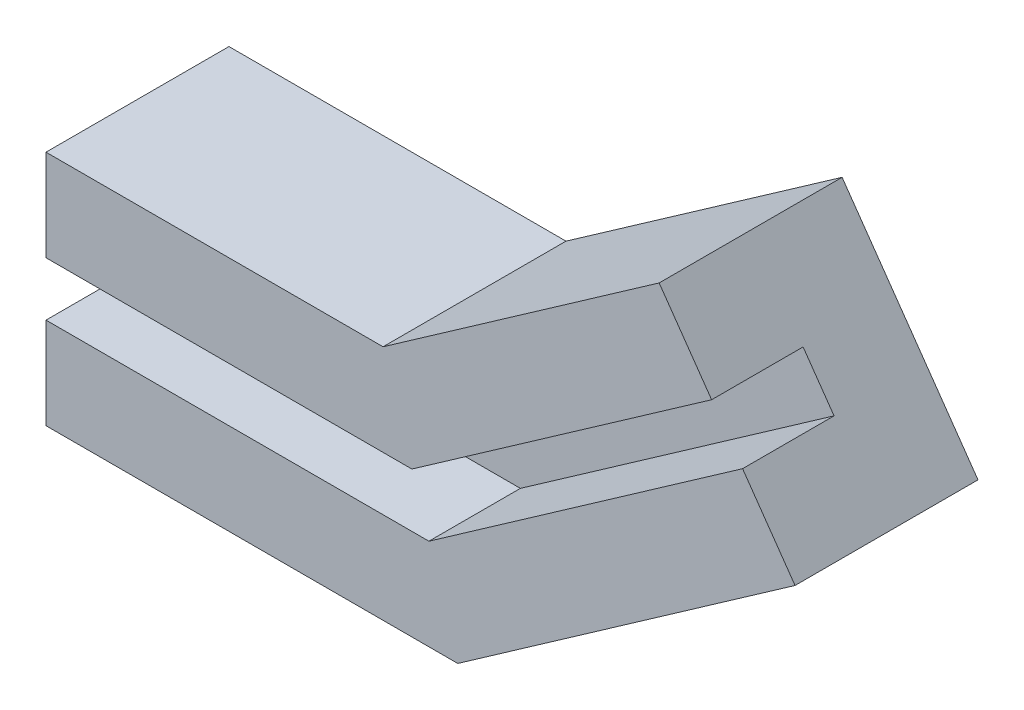
ISO-10303-21;
HEADER;
FILE_DESCRIPTION(('STEP AP214'),'2;1');
FILE_NAME('part.step','',(''),(''),'','','');
FILE_SCHEMA(('AUTOMOTIVE_DESIGN { 1 0 10303 214 1 1 1 1 }'));
ENDSEC;
DATA;
#1=APPLICATION_CONTEXT('core data for automotive mechanical design processes');
#2=APPLICATION_PROTOCOL_DEFINITION('international standard','automotive_design',2000,#1);
#3=PRODUCT_CONTEXT('',#1,'mechanical');
#4=PRODUCT('Part','Part','',(#3));
#5=PRODUCT_RELATED_PRODUCT_CATEGORY('part','',(#4));
#6=PRODUCT_DEFINITION_FORMATION('','',#4);
#7=PRODUCT_DEFINITION_CONTEXT('part definition',#1,'design');
#8=PRODUCT_DEFINITION('design','',#6,#7);
#9=PRODUCT_DEFINITION_SHAPE('','',#8);
#10=(LENGTH_UNIT() NAMED_UNIT(*) SI_UNIT(.MILLI.,.METRE.));
#11=(NAMED_UNIT(*) PLANE_ANGLE_UNIT() SI_UNIT($,.RADIAN.));
#12=(NAMED_UNIT(*) SI_UNIT($,.STERADIAN.) SOLID_ANGLE_UNIT());
#13=UNCERTAINTY_MEASURE_WITH_UNIT(LENGTH_MEASURE(1.E-05),#10,'distance_accuracy_value','');
#14=(GEOMETRIC_REPRESENTATION_CONTEXT(3) GLOBAL_UNCERTAINTY_ASSIGNED_CONTEXT((#13)) GLOBAL_UNIT_ASSIGNED_CONTEXT((#10,
#11,#12)) REPRESENTATION_CONTEXT('',''));
#15=CARTESIAN_POINT('',(0.,0.,0.));
#16=DIRECTION('',(0.,0.,1.));
#17=DIRECTION('',(1.,0.,0.));
#18=AXIS2_PLACEMENT_3D('',#15,#16,#17);
#19=CARTESIAN_POINT('',(7.09760461879658,-10.1364298889779,10.));
#20=DIRECTION('',(0.573576436351047,-0.819152044288991,0.));
#21=DIRECTION('',(0.819152044288991,0.573576436351047,0.));
#22=AXIS2_PLACEMENT_3D('',#19,#20,#21);
#23=PLANE('',#22);
#24=DIRECTION('',(-0.819152044288991,-0.573576436351047,0.));
#25=VECTOR('',#24,1.);
#26=CARTESIAN_POINT('',(7.09760461879658,-10.1364298889779,0.));
#27=LINE('',#26,#25);
#28=CARTESIAN_POINT('',(62.7660817715596,28.8430574540419,0.));
#29=VERTEX_POINT('',#28);
#30=CARTESIAN_POINT('',(30.,5.9,0.));
#31=VERTEX_POINT('',#30);
#32=EDGE_CURVE('E224',#29,#31,#27,.T.);
#33=ORIENTED_EDGE('',*,*,#32,.F.);
#34=DIRECTION('',(0.,0.,-1.));
#35=VECTOR('',#34,1.);
#36=CARTESIAN_POINT('',(62.7660817715596,28.8430574540419,10.));
#37=LINE('',#36,#35);
#38=CARTESIAN_POINT('',(62.7660817715596,28.8430574540419,10.));
#39=VERTEX_POINT('',#38);
#40=EDGE_CURVE('E12',#39,#29,#37,.T.);
#41=ORIENTED_EDGE('',*,*,#40,.F.);
#42=DIRECTION('',(-0.819152044288991,-0.573576436351047,0.));
#43=VECTOR('',#42,1.);
#44=CARTESIAN_POINT('',(7.09760461879658,-10.1364298889779,10.));
#45=LINE('',#44,#43);
#46=CARTESIAN_POINT('',(30.,5.9,10.));
#47=VERTEX_POINT('',#46);
#48=EDGE_CURVE('E225',#39,#47,#45,.T.);
#49=ORIENTED_EDGE('',*,*,#48,.T.);
#50=DIRECTION('',(0.,0.,-1.));
#51=VECTOR('',#50,1.);
#52=CARTESIAN_POINT('',(30.,5.9,10.));
#53=LINE('',#52,#51);
#54=EDGE_CURVE('E240',#47,#31,#53,.T.);
#55=ORIENTED_EDGE('',*,*,#54,.T.);
#56=EDGE_LOOP('',(#33,#41,#49,#55));
#57=FACE_BOUND('',#56,.T.);
#58=ADVANCED_FACE('F74',(#57),#23,.T.);
#59=CARTESIAN_POINT('',(55.668477152763,38.9794873430198,10.));
#60=DIRECTION('',(-0.819152044288991,-0.573576436351047,0.));
#61=DIRECTION('',(0.573576436351047,-0.819152044288991,0.));
#62=AXIS2_PLACEMENT_3D('',#59,#60,#61);
#63=PLANE('',#62);
#64=ORIENTED_EDGE('',*,*,#40,.T.);
#65=DIRECTION('',(0.573576436351047,-0.819152044288991,0.));
#66=VECTOR('',#65,1.);
#67=CARTESIAN_POINT('',(55.6684771527631,38.9794873430198,0.));
#68=LINE('',#67,#66);
#69=CARTESIAN_POINT('',(66.1501827460308,24.0100603927368,0.));
#70=VERTEX_POINT('',#69);
#71=EDGE_CURVE('E168',#29,#70,#68,.T.);
#72=ORIENTED_EDGE('',*,*,#71,.T.);
#73=DIRECTION('',(0.,0.,-1.));
#74=VECTOR('',#73,1.);
#75=CARTESIAN_POINT('',(66.1501827460308,24.0100603927368,10.));
#76=LINE('',#75,#74);
#77=CARTESIAN_POINT('',(66.1501827460308,24.0100603927368,10.));
#78=VERTEX_POINT('',#77);
#79=EDGE_CURVE('E193',#78,#70,#76,.T.);
#80=ORIENTED_EDGE('',*,*,#79,.F.);
#81=DIRECTION('',(-0.573576436351047,0.819152044288991,0.));
#82=VECTOR('',#81,1.);
#83=CARTESIAN_POINT('',(55.668477152763,38.9794873430198,10.));
#84=LINE('',#83,#82);
#85=CARTESIAN_POINT('',(71.8859471095413,15.8185399498469,10.));
#86=VERTEX_POINT('',#85);
#87=EDGE_CURVE('E178',#86,#78,#84,.T.);
#88=ORIENTED_EDGE('',*,*,#87,.F.);
#89=DIRECTION('',(0.,0.,1.));
#90=VECTOR('',#89,1.);
#91=CARTESIAN_POINT('',(71.8859471095413,15.8185399498469,-10.));
#92=LINE('',#91,#90);
#93=CARTESIAN_POINT('',(71.8859471095413,15.8185399498469,-10.));
#94=VERTEX_POINT('',#93);
#95=EDGE_CURVE('E222',#94,#86,#92,.T.);
#96=ORIENTED_EDGE('',*,*,#95,.F.);
#97=DIRECTION('',(0.573576436351047,-0.819152044288991,0.));
#98=VECTOR('',#97,1.);
#99=CARTESIAN_POINT('',(55.6684771527631,38.9794873430198,-10.));
#100=LINE('',#99,#98);
#101=CARTESIAN_POINT('',(57.0303174080492,37.0345778969318,-10.));
#102=VERTEX_POINT('',#101);
#103=EDGE_CURVE('E204',#102,#94,#100,.T.);
#104=ORIENTED_EDGE('',*,*,#103,.F.);
#105=DIRECTION('',(0.,0.,-1.));
#106=VECTOR('',#105,1.);
#107=CARTESIAN_POINT('',(57.0303174080491,37.0345778969318,10.));
#108=LINE('',#107,#106);
#109=CARTESIAN_POINT('',(57.0303174080491,37.0345778969318,10.));
#110=VERTEX_POINT('',#109);
#111=EDGE_CURVE('E81',#110,#102,#108,.T.);
#112=ORIENTED_EDGE('',*,*,#111,.F.);
#113=DIRECTION('',(-0.573576436351047,0.819152044288991,0.));
#114=VECTOR('',#113,1.);
#115=CARTESIAN_POINT('',(55.668477152763,38.9794873430198,10.));
#116=LINE('',#115,#114);
#117=EDGE_CURVE('E228',#39,#110,#116,.T.);
#118=ORIENTED_EDGE('',*,*,#117,.F.);
#119=EDGE_LOOP('',(#64,#72,#80,#88,#96,#104,#112,#118));
#120=FACE_BOUND('',#119,.T.);
#121=ADVANCED_FACE('F265',(#120),#63,.F.);
#122=CARTESIAN_POINT('',(1.36184025528611,-1.94490944608802,10.));
#123=DIRECTION('',(0.573576436351047,-0.819152044288991,0.));
#124=DIRECTION('',(0.819152044288991,0.573576436351047,0.));
#125=AXIS2_PLACEMENT_3D('',#122,#123,#124);
#126=PLANE('',#125);
#127=ORIENTED_EDGE('',*,*,#111,.T.);
#128=DIRECTION('',(0.819152044288991,0.573576436351047,0.));
#129=VECTOR('',#128,1.);
#130=CARTESIAN_POINT('',(1.36184025528611,-1.94490944608802,-10.));
#131=LINE('',#130,#129);
#132=CARTESIAN_POINT('',(26.8470121112102,15.9,-10.));
#133=VERTEX_POINT('',#132);
#134=EDGE_CURVE('E201',#133,#102,#131,.T.);
#135=ORIENTED_EDGE('',*,*,#134,.F.);
#136=DIRECTION('',(0.,0.,-1.));
#137=VECTOR('',#136,1.);
#138=CARTESIAN_POINT('',(26.8470121112102,15.9,10.));
#139=LINE('',#138,#137);
#140=CARTESIAN_POINT('',(26.8470121112102,15.9,10.));
#141=VERTEX_POINT('',#140);
#142=EDGE_CURVE('E250',#141,#133,#139,.T.);
#143=ORIENTED_EDGE('',*,*,#142,.F.);
#144=DIRECTION('',(-0.819152044288991,-0.573576436351047,0.));
#145=VECTOR('',#144,1.);
#146=CARTESIAN_POINT('',(1.36184025528611,-1.94490944608802,10.));
#147=LINE('',#146,#145);
#148=EDGE_CURVE('E231',#110,#141,#147,.T.);
#149=ORIENTED_EDGE('',*,*,#148,.F.);
#150=EDGE_LOOP('',(#127,#135,#143,#149));
#151=FACE_BOUND('',#150,.T.);
#152=ADVANCED_FACE('F255',(#151),#126,.F.);
#153=CARTESIAN_POINT('',(0.,15.9,10.));
#154=DIRECTION('',(0.,-1.,0.));
#155=DIRECTION('',(1.,0.,0.));
#156=AXIS2_PLACEMENT_3D('',#153,#154,#155);
#157=PLANE('',#156);
#158=ORIENTED_EDGE('',*,*,#142,.T.);
#159=DIRECTION('',(1.,0.,0.));
#160=VECTOR('',#159,1.);
#161=CARTESIAN_POINT('',(0.,15.9,-10.));
#162=LINE('',#161,#160);
#163=CARTESIAN_POINT('',(-10.,15.9,-10.));
#164=VERTEX_POINT('',#163);
#165=EDGE_CURVE('E198',#164,#133,#162,.T.);
#166=ORIENTED_EDGE('',*,*,#165,.F.);
#167=DIRECTION('',(0.,0.,-1.));
#168=VECTOR('',#167,1.);
#169=CARTESIAN_POINT('',(-10.,15.9,10.));
#170=LINE('',#169,#168);
#171=CARTESIAN_POINT('',(-10.,15.9,10.));
#172=VERTEX_POINT('',#171);
#173=EDGE_CURVE('E248',#172,#164,#170,.T.);
#174=ORIENTED_EDGE('',*,*,#173,.F.);
#175=DIRECTION('',(-1.,0.,0.));
#176=VECTOR('',#175,1.);
#177=CARTESIAN_POINT('',(0.,15.9,10.));
#178=LINE('',#177,#176);
#179=EDGE_CURVE('E233',#141,#172,#178,.T.);
#180=ORIENTED_EDGE('',*,*,#179,.F.);
#181=EDGE_LOOP('',(#158,#166,#174,#180));
#182=FACE_BOUND('',#181,.T.);
#183=ADVANCED_FACE('F279',(#182),#157,.F.);
#184=CARTESIAN_POINT('',(-10.,0.,10.));
#185=DIRECTION('',(1.,0.,0.));
#186=DIRECTION('',(0.,1.,0.));
#187=AXIS2_PLACEMENT_3D('',#184,#185,#186);
#188=PLANE('',#187);
#189=ORIENTED_EDGE('',*,*,#173,.T.);
#190=DIRECTION('',(0.,1.,0.));
#191=VECTOR('',#190,1.);
#192=CARTESIAN_POINT('',(-10.,0.,-10.));
#193=LINE('',#192,#191);
#194=CARTESIAN_POINT('',(-10.,-10.,-10.));
#195=VERTEX_POINT('',#194);
#196=EDGE_CURVE('E212',#195,#164,#193,.T.);
#197=ORIENTED_EDGE('',*,*,#196,.F.);
#198=DIRECTION('',(0.,0.,1.));
#199=VECTOR('',#198,1.);
#200=CARTESIAN_POINT('',(-10.,-10.,-10.));
#201=LINE('',#200,#199);
#202=CARTESIAN_POINT('',(-10.,-10.,10.));
#203=VERTEX_POINT('',#202);
#204=EDGE_CURVE('E215',#195,#203,#201,.T.);
#205=ORIENTED_EDGE('',*,*,#204,.T.);
#206=DIRECTION('',(0.,-1.,0.));
#207=VECTOR('',#206,1.);
#208=CARTESIAN_POINT('',(-10.,0.,10.));
#209=LINE('',#208,#207);
#210=CARTESIAN_POINT('',(-10.,0.,10.));
#211=VERTEX_POINT('',#210);
#212=EDGE_CURVE('E183',#211,#203,#209,.T.);
#213=ORIENTED_EDGE('',*,*,#212,.F.);
#214=DIRECTION('',(0.,0.,-1.));
#215=VECTOR('',#214,1.);
#216=CARTESIAN_POINT('',(-10.,0.,10.));
#217=LINE('',#216,#215);
#218=CARTESIAN_POINT('',(-10.,0.,0.));
#219=VERTEX_POINT('',#218);
#220=EDGE_CURVE('E169',#211,#219,#217,.T.);
#221=ORIENTED_EDGE('',*,*,#220,.T.);
#222=DIRECTION('',(0.,1.,0.));
#223=VECTOR('',#222,1.);
#224=CARTESIAN_POINT('',(-10.,0.,0.));
#225=LINE('',#224,#223);
#226=CARTESIAN_POINT('',(-10.,5.9,0.));
#227=VERTEX_POINT('',#226);
#228=EDGE_CURVE('E93',#219,#227,#225,.T.);
#229=ORIENTED_EDGE('',*,*,#228,.T.);
#230=DIRECTION('',(0.,0.,-1.));
#231=VECTOR('',#230,1.);
#232=CARTESIAN_POINT('',(-10.,5.9,10.));
#233=LINE('',#232,#231);
#234=CARTESIAN_POINT('',(-10.,5.9,10.));
#235=VERTEX_POINT('',#234);
#236=EDGE_CURVE('E245',#235,#227,#233,.T.);
#237=ORIENTED_EDGE('',*,*,#236,.F.);
#238=DIRECTION('',(0.,-1.,0.));
#239=VECTOR('',#238,1.);
#240=CARTESIAN_POINT('',(-10.,0.,10.));
#241=LINE('',#240,#239);
#242=EDGE_CURVE('E235',#172,#235,#241,.T.);
#243=ORIENTED_EDGE('',*,*,#242,.F.);
#244=EDGE_LOOP('',(#189,#197,#205,#213,#221,#229,#237,#243));
#245=FACE_BOUND('',#244,.T.);
#246=ADVANCED_FACE('F275',(#245),#188,.F.);
#247=CARTESIAN_POINT('',(0.,5.9,10.));
#248=DIRECTION('',(0.,-1.,0.));
#249=DIRECTION('',(1.,0.,0.));
#250=AXIS2_PLACEMENT_3D('',#247,#248,#249);
#251=PLANE('',#250);
#252=DIRECTION('',(-1.,0.,0.));
#253=VECTOR('',#252,1.);
#254=CARTESIAN_POINT('',(0.,5.9,0.));
#255=LINE('',#254,#253);
#256=EDGE_CURVE('E229',#31,#227,#255,.T.);
#257=ORIENTED_EDGE('',*,*,#256,.F.);
#258=ORIENTED_EDGE('',*,*,#54,.F.);
#259=DIRECTION('',(-1.,0.,0.));
#260=VECTOR('',#259,1.);
#261=CARTESIAN_POINT('',(0.,5.9,10.));
#262=LINE('',#261,#260);
#263=EDGE_CURVE('E237',#47,#235,#262,.T.);
#264=ORIENTED_EDGE('',*,*,#263,.T.);
#265=ORIENTED_EDGE('',*,*,#236,.T.);
#266=EDGE_LOOP('',(#257,#258,#264,#265));
#267=FACE_BOUND('',#266,.T.);
#268=ADVANCED_FACE('F298',(#267),#251,.T.);
#269=CARTESIAN_POINT('',(0.,0.,10.));
#270=DIRECTION('',(0.,0.,1.));
#271=DIRECTION('',(1.,0.,0.));
#272=AXIS2_PLACEMENT_3D('',#269,#270,#271);
#273=PLANE('',#272);
#274=ORIENTED_EDGE('',*,*,#48,.F.);
#275=ORIENTED_EDGE('',*,*,#117,.T.);
#276=ORIENTED_EDGE('',*,*,#148,.T.);
#277=ORIENTED_EDGE('',*,*,#179,.T.);
#278=ORIENTED_EDGE('',*,*,#242,.T.);
#279=ORIENTED_EDGE('',*,*,#263,.F.);
#280=EDGE_LOOP('',(#274,#275,#276,#277,#278,#279));
#281=FACE_BOUND('',#280,.T.);
#282=ADVANCED_FACE('F283',(#281),#273,.T.);
#283=CARTESIAN_POINT('',(0.,0.,0.));
#284=DIRECTION('',(0.,0.,-1.));
#285=DIRECTION('',(-1.,0.,0.));
#286=AXIS2_PLACEMENT_3D('',#283,#284,#285);
#287=PLANE('',#286);
#288=DIRECTION('',(1.,0.,0.));
#289=VECTOR('',#288,1.);
#290=CARTESIAN_POINT('',(0.,0.,0.));
#291=LINE('',#290,#289);
#292=CARTESIAN_POINT('',(31.860262854386,0.,0.));
#293=VERTEX_POINT('',#292);
#294=EDGE_CURVE('E88',#219,#293,#291,.T.);
#295=ORIENTED_EDGE('',*,*,#294,.T.);
#296=DIRECTION('',(0.819152044288991,0.573576436351047,0.));
#297=VECTOR('',#296,1.);
#298=CARTESIAN_POINT('',(10.4817055932677,-14.969426950283,0.));
#299=LINE('',#298,#297);
#300=EDGE_CURVE('E165',#293,#70,#299,.T.);
#301=ORIENTED_EDGE('',*,*,#300,.T.);
#302=ORIENTED_EDGE('',*,*,#71,.F.);
#303=ORIENTED_EDGE('',*,*,#32,.T.);
#304=ORIENTED_EDGE('',*,*,#256,.T.);
#305=ORIENTED_EDGE('',*,*,#228,.F.);
#306=EDGE_LOOP('',(#295,#301,#302,#303,#304,#305));
#307=FACE_BOUND('',#306,.T.);
#308=ADVANCED_FACE('F290',(#307),#287,.F.);
#309=CARTESIAN_POINT('',(16.2174699567782,-23.1609473931729,-10.));
#310=DIRECTION('',(0.573576436351047,-0.819152044288991,0.));
#311=DIRECTION('',(0.819152044288991,0.573576436351047,0.));
#312=AXIS2_PLACEMENT_3D('',#309,#310,#311);
#313=PLANE('',#312);
#314=ORIENTED_EDGE('',*,*,#95,.T.);
#315=DIRECTION('',(0.819152044288991,0.573576436351048,0.));
#316=VECTOR('',#315,1.);
#317=CARTESIAN_POINT('',(16.2174699567782,-23.1609473931729,10.));
#318=LINE('',#317,#316);
#319=CARTESIAN_POINT('',(35.0132507431758,-10.,10.));
#320=VERTEX_POINT('',#319);
#321=EDGE_CURVE('E190',#320,#86,#318,.T.);
#322=ORIENTED_EDGE('',*,*,#321,.F.);
#323=DIRECTION('',(0.,0.,1.));
#324=VECTOR('',#323,1.);
#325=CARTESIAN_POINT('',(35.0132507431758,-10.,-10.));
#326=LINE('',#325,#324);
#327=CARTESIAN_POINT('',(35.0132507431758,-10.,-10.));
#328=VERTEX_POINT('',#327);
#329=EDGE_CURVE('E220',#328,#320,#326,.T.);
#330=ORIENTED_EDGE('',*,*,#329,.F.);
#331=DIRECTION('',(0.819152044288991,0.573576436351047,0.));
#332=VECTOR('',#331,1.);
#333=CARTESIAN_POINT('',(16.2174699567782,-23.1609473931729,-10.));
#334=LINE('',#333,#332);
#335=EDGE_CURVE('E206',#328,#94,#334,.T.);
#336=ORIENTED_EDGE('',*,*,#335,.T.);
#337=EDGE_LOOP('',(#314,#322,#330,#336));
#338=FACE_BOUND('',#337,.T.);
#339=ADVANCED_FACE('F268',(#338),#313,.T.);
#340=CARTESIAN_POINT('',(0.,-10.,-10.));
#341=DIRECTION('',(0.,-1.,0.));
#342=DIRECTION('',(0.,0.,-1.));
#343=AXIS2_PLACEMENT_3D('',#340,#341,#342);
#344=PLANE('',#343);
#345=ORIENTED_EDGE('',*,*,#329,.T.);
#346=DIRECTION('',(1.,0.,0.));
#347=VECTOR('',#346,1.);
#348=CARTESIAN_POINT('',(0.,-10.,10.));
#349=LINE('',#348,#347);
#350=EDGE_CURVE('E185',#203,#320,#349,.T.);
#351=ORIENTED_EDGE('',*,*,#350,.F.);
#352=ORIENTED_EDGE('',*,*,#204,.F.);
#353=DIRECTION('',(1.,0.,0.));
#354=VECTOR('',#353,1.);
#355=CARTESIAN_POINT('',(0.,-10.,-10.));
#356=LINE('',#355,#354);
#357=EDGE_CURVE('E209',#195,#328,#356,.T.);
#358=ORIENTED_EDGE('',*,*,#357,.T.);
#359=EDGE_LOOP('',(#345,#351,#352,#358));
#360=FACE_BOUND('',#359,.T.);
#361=ADVANCED_FACE('F271',(#360),#344,.T.);
#362=CARTESIAN_POINT('',(0.,0.,-10.));
#363=DIRECTION('',(0.,0.,-1.));
#364=DIRECTION('',(-1.,0.,0.));
#365=AXIS2_PLACEMENT_3D('',#362,#363,#364);
#366=PLANE('',#365);
#367=ORIENTED_EDGE('',*,*,#165,.T.);
#368=ORIENTED_EDGE('',*,*,#134,.T.);
#369=ORIENTED_EDGE('',*,*,#103,.T.);
#370=ORIENTED_EDGE('',*,*,#335,.F.);
#371=ORIENTED_EDGE('',*,*,#357,.F.);
#372=ORIENTED_EDGE('',*,*,#196,.T.);
#373=EDGE_LOOP('',(#367,#368,#369,#370,#371,#372));
#374=FACE_BOUND('',#373,.T.);
#375=ADVANCED_FACE('F261',(#374),#366,.T.);
#376=CARTESIAN_POINT('',(10.4817055932677,-14.969426950283,10.));
#377=DIRECTION('',(-0.573576436351047,0.819152044288991,0.));
#378=DIRECTION('',(-0.819152044288991,-0.573576436351047,0.));
#379=AXIS2_PLACEMENT_3D('',#376,#377,#378);
#380=PLANE('',#379);
#381=ORIENTED_EDGE('',*,*,#300,.F.);
#382=DIRECTION('',(0.,0.,-1.));
#383=VECTOR('',#382,1.);
#384=CARTESIAN_POINT('',(31.860262854386,0.,10.));
#385=LINE('',#384,#383);
#386=CARTESIAN_POINT('',(31.860262854386,0.,10.));
#387=VERTEX_POINT('',#386);
#388=EDGE_CURVE('E160',#387,#293,#385,.T.);
#389=ORIENTED_EDGE('',*,*,#388,.F.);
#390=DIRECTION('',(0.819152044288991,0.573576436351047,0.));
#391=VECTOR('',#390,1.);
#392=CARTESIAN_POINT('',(10.4817055932677,-14.969426950283,10.));
#393=LINE('',#392,#391);
#394=EDGE_CURVE('E164',#387,#78,#393,.T.);
#395=ORIENTED_EDGE('',*,*,#394,.T.);
#396=ORIENTED_EDGE('',*,*,#79,.T.);
#397=EDGE_LOOP('',(#381,#389,#395,#396));
#398=FACE_BOUND('',#397,.T.);
#399=ADVANCED_FACE('F162',(#398),#380,.T.);
#400=CARTESIAN_POINT('',(0.,0.,10.));
#401=DIRECTION('',(0.,1.,0.));
#402=DIRECTION('',(0.,0.,1.));
#403=AXIS2_PLACEMENT_3D('',#400,#401,#402);
#404=PLANE('',#403);
#405=ORIENTED_EDGE('',*,*,#294,.F.);
#406=ORIENTED_EDGE('',*,*,#220,.F.);
#407=DIRECTION('',(1.,0.,0.));
#408=VECTOR('',#407,1.);
#409=CARTESIAN_POINT('',(0.,0.,10.));
#410=LINE('',#409,#408);
#411=EDGE_CURVE('E175',#211,#387,#410,.T.);
#412=ORIENTED_EDGE('',*,*,#411,.T.);
#413=ORIENTED_EDGE('',*,*,#388,.T.);
#414=EDGE_LOOP('',(#405,#406,#412,#413));
#415=FACE_BOUND('',#414,.T.);
#416=ADVANCED_FACE('F181',(#415),#404,.T.);
#417=CARTESIAN_POINT('',(0.,0.,10.));
#418=DIRECTION('',(0.,0.,1.));
#419=DIRECTION('',(1.,0.,0.));
#420=AXIS2_PLACEMENT_3D('',#417,#418,#419);
#421=PLANE('',#420);
#422=ORIENTED_EDGE('',*,*,#394,.F.);
#423=ORIENTED_EDGE('',*,*,#411,.F.);
#424=ORIENTED_EDGE('',*,*,#212,.T.);
#425=ORIENTED_EDGE('',*,*,#350,.T.);
#426=ORIENTED_EDGE('',*,*,#321,.T.);
#427=ORIENTED_EDGE('',*,*,#87,.T.);
#428=EDGE_LOOP('',(#422,#423,#424,#425,#426,#427));
#429=FACE_BOUND('',#428,.T.);
#430=ADVANCED_FACE('F173',(#429),#421,.T.);
#431=CLOSED_SHELL('',(#58,#121,#152,#183,#246,#268,#282,#308,#339,#361,#375,#399,#416,#430));
#432=MANIFOLD_SOLID_BREP('B2',#431);
#433=ADVANCED_BREP_SHAPE_REPRESENTATION('',(#18,#432),#14);
#434=SHAPE_DEFINITION_REPRESENTATION(#9,#433);
ENDSEC;
END-ISO-10303-21;
